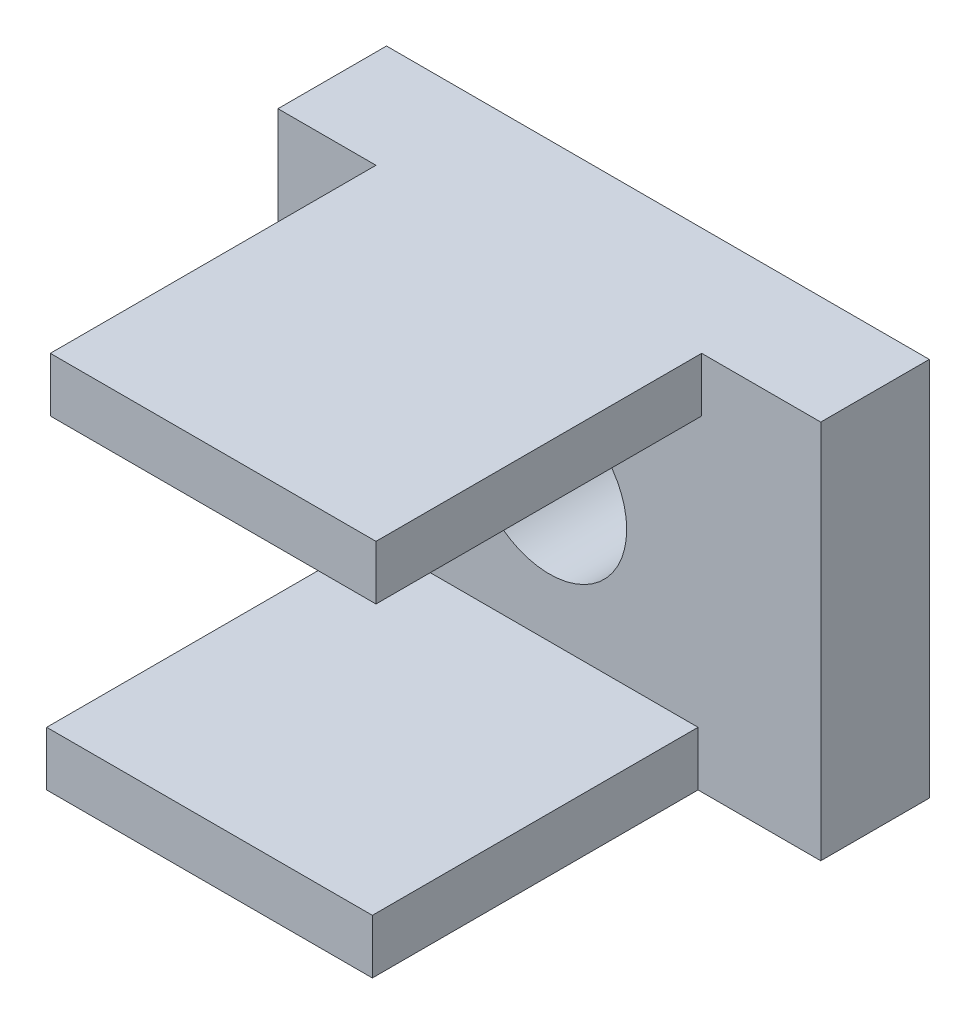
ISO-10303-21;
HEADER;
FILE_DESCRIPTION(('STEP AP214'),'2;1');
FILE_NAME('part.step','',(''),(''),'','','');
FILE_SCHEMA(('AUTOMOTIVE_DESIGN { 1 0 10303 214 1 1 1 1 }'));
ENDSEC;
DATA;
#1=APPLICATION_CONTEXT('core data for automotive mechanical design processes');
#2=APPLICATION_PROTOCOL_DEFINITION('international standard','automotive_design',2000,#1);
#3=PRODUCT_CONTEXT('',#1,'mechanical');
#4=PRODUCT('Part','Part','',(#3));
#5=PRODUCT_RELATED_PRODUCT_CATEGORY('part','',(#4));
#6=PRODUCT_DEFINITION_FORMATION('','',#4);
#7=PRODUCT_DEFINITION_CONTEXT('part definition',#1,'design');
#8=PRODUCT_DEFINITION('design','',#6,#7);
#9=PRODUCT_DEFINITION_SHAPE('','',#8);
#10=(LENGTH_UNIT() NAMED_UNIT(*) SI_UNIT(.MILLI.,.METRE.));
#11=(NAMED_UNIT(*) PLANE_ANGLE_UNIT() SI_UNIT($,.RADIAN.));
#12=(NAMED_UNIT(*) SI_UNIT($,.STERADIAN.) SOLID_ANGLE_UNIT());
#13=UNCERTAINTY_MEASURE_WITH_UNIT(LENGTH_MEASURE(1.E-05),#10,'distance_accuracy_value','');
#14=(GEOMETRIC_REPRESENTATION_CONTEXT(3) GLOBAL_UNCERTAINTY_ASSIGNED_CONTEXT((#13)) GLOBAL_UNIT_ASSIGNED_CONTEXT((#10,
#11,#12)) REPRESENTATION_CONTEXT('',''));
#15=CARTESIAN_POINT('',(0.,0.,0.));
#16=DIRECTION('',(0.,0.,1.));
#17=DIRECTION('',(1.,0.,0.));
#18=AXIS2_PLACEMENT_3D('',#15,#16,#17);
#19=CARTESIAN_POINT('',(0.,0.,2.));
#20=DIRECTION('',(0.,0.,1.));
#21=DIRECTION('',(1.,0.,0.));
#22=AXIS2_PLACEMENT_3D('',#19,#20,#21);
#23=PLANE('',#22);
#24=CARTESIAN_POINT('',(0.,0.,2.));
#25=DIRECTION('',(0.,0.,1.));
#26=DIRECTION('',(1.,0.,0.));
#27=AXIS2_PLACEMENT_3D('',#24,#25,#26);
#28=CIRCLE('',#27,1.425);
#29=CARTESIAN_POINT('',(1.425,0.,2.));
#30=VERTEX_POINT('',#29);
#31=EDGE_CURVE('E409',#30,#30,#28,.T.);
#32=ORIENTED_EDGE('',*,*,#31,.F.);
#33=EDGE_LOOP('',(#32));
#34=FACE_BOUND('',#33,.T.);
#35=DIRECTION('',(-1.,0.,0.));
#36=VECTOR('',#35,1.);
#37=CARTESIAN_POINT('',(-3.26050355642215,-2.5,2.));
#38=LINE('',#37,#36);
#39=CARTESIAN_POINT('',(2.73949644357785,-2.5,2.));
#40=VERTEX_POINT('',#39);
#41=CARTESIAN_POINT('',(-3.26050355642215,-2.5,2.));
#42=VERTEX_POINT('',#41);
#43=EDGE_CURVE('E56',#40,#42,#38,.T.);
#44=ORIENTED_EDGE('',*,*,#43,.F.);
#45=DIRECTION('',(0.,1.,0.));
#46=VECTOR('',#45,1.);
#47=CARTESIAN_POINT('',(2.73949644357785,-2.5,2.));
#48=LINE('',#47,#46);
#49=CARTESIAN_POINT('',(2.73949644357785,-3.5,2.));
#50=VERTEX_POINT('',#49);
#51=EDGE_CURVE('E152',#50,#40,#48,.T.);
#52=ORIENTED_EDGE('',*,*,#51,.F.);
#53=DIRECTION('',(1.,0.,0.));
#54=VECTOR('',#53,1.);
#55=CARTESIAN_POINT('',(-5.,-3.5,2.));
#56=LINE('',#55,#54);
#57=CARTESIAN_POINT('',(5.,-3.5,2.));
#58=VERTEX_POINT('',#57);
#59=EDGE_CURVE('E214',#50,#58,#56,.T.);
#60=ORIENTED_EDGE('',*,*,#59,.T.);
#61=DIRECTION('',(0.,1.,0.));
#62=VECTOR('',#61,1.);
#63=CARTESIAN_POINT('',(5.,3.5,2.));
#64=LINE('',#63,#62);
#65=CARTESIAN_POINT('',(5.,3.5,2.));
#66=VERTEX_POINT('',#65);
#67=EDGE_CURVE('E202',#58,#66,#64,.T.);
#68=ORIENTED_EDGE('',*,*,#67,.T.);
#69=DIRECTION('',(-1.,0.,0.));
#70=VECTOR('',#69,1.);
#71=CARTESIAN_POINT('',(-5.,3.5,2.));
#72=LINE('',#71,#70);
#73=CARTESIAN_POINT('',(2.80607660162224,3.5,2.));
#74=VERTEX_POINT('',#73);
#75=EDGE_CURVE('E208',#66,#74,#72,.T.);
#76=ORIENTED_EDGE('',*,*,#75,.T.);
#77=DIRECTION('',(0.,1.,0.));
#78=VECTOR('',#77,1.);
#79=CARTESIAN_POINT('',(2.80607660162224,2.5,2.));
#80=LINE('',#79,#78);
#81=CARTESIAN_POINT('',(2.80607660162224,2.5,2.));
#82=VERTEX_POINT('',#81);
#83=EDGE_CURVE('E154',#82,#74,#80,.T.);
#84=ORIENTED_EDGE('',*,*,#83,.F.);
#85=DIRECTION('',(1.,0.,0.));
#86=VECTOR('',#85,1.);
#87=CARTESIAN_POINT('',(-3.19392339837776,2.5,2.));
#88=LINE('',#87,#86);
#89=CARTESIAN_POINT('',(-3.19392339837776,2.5,2.));
#90=VERTEX_POINT('',#89);
#91=EDGE_CURVE('E170',#90,#82,#88,.T.);
#92=ORIENTED_EDGE('',*,*,#91,.F.);
#93=DIRECTION('',(0.,-1.,0.));
#94=VECTOR('',#93,1.);
#95=CARTESIAN_POINT('',(-3.19392339837776,2.5,2.));
#96=LINE('',#95,#94);
#97=CARTESIAN_POINT('',(-3.19392339837776,3.5,2.));
#98=VERTEX_POINT('',#97);
#99=EDGE_CURVE('E159',#98,#90,#96,.T.);
#100=ORIENTED_EDGE('',*,*,#99,.F.);
#101=CARTESIAN_POINT('',(-5.,3.5,2.));
#102=VERTEX_POINT('',#101);
#103=EDGE_CURVE('E206',#98,#102,#72,.T.);
#104=ORIENTED_EDGE('',*,*,#103,.T.);
#105=DIRECTION('',(0.,-1.,0.));
#106=VECTOR('',#105,1.);
#107=CARTESIAN_POINT('',(-5.,3.5,2.));
#108=LINE('',#107,#106);
#109=CARTESIAN_POINT('',(-5.,-3.5,2.));
#110=VERTEX_POINT('',#109);
#111=EDGE_CURVE('E211',#102,#110,#108,.T.);
#112=ORIENTED_EDGE('',*,*,#111,.T.);
#113=CARTESIAN_POINT('',(-3.26050355642215,-3.5,2.));
#114=VERTEX_POINT('',#113);
#115=EDGE_CURVE('E215',#110,#114,#56,.T.);
#116=ORIENTED_EDGE('',*,*,#115,.T.);
#117=DIRECTION('',(0.,-1.,0.));
#118=VECTOR('',#117,1.);
#119=CARTESIAN_POINT('',(-3.26050355642215,-2.5,2.));
#120=LINE('',#119,#118);
#121=EDGE_CURVE('E61',#42,#114,#120,.T.);
#122=ORIENTED_EDGE('',*,*,#121,.F.);
#123=EDGE_LOOP('',(#44,#52,#60,#68,#76,#84,#92,#100,#104,#112,#116,#122));
#124=FACE_BOUND('',#123,.T.);
#125=ADVANCED_FACE('F39',(#34,#124),#23,.T.);
#126=CARTESIAN_POINT('',(5.,3.5,2.));
#127=DIRECTION('',(-1.,0.,0.));
#128=DIRECTION('',(0.,0.,1.));
#129=AXIS2_PLACEMENT_3D('',#126,#127,#128);
#130=PLANE('',#129);
#131=DIRECTION('',(0.,1.,0.));
#132=VECTOR('',#131,1.);
#133=CARTESIAN_POINT('',(5.,3.5,0.));
#134=LINE('',#133,#132);
#135=CARTESIAN_POINT('',(5.,-3.5,0.));
#136=VERTEX_POINT('',#135);
#137=CARTESIAN_POINT('',(5.,3.5,0.));
#138=VERTEX_POINT('',#137);
#139=EDGE_CURVE('E201',#136,#138,#134,.T.);
#140=ORIENTED_EDGE('',*,*,#139,.T.);
#141=DIRECTION('',(0.,0.,-1.));
#142=VECTOR('',#141,1.);
#143=CARTESIAN_POINT('',(5.,3.5,2.));
#144=LINE('',#143,#142);
#145=EDGE_CURVE('E11',#66,#138,#144,.T.);
#146=ORIENTED_EDGE('',*,*,#145,.F.);
#147=ORIENTED_EDGE('',*,*,#67,.F.);
#148=DIRECTION('',(0.,0.,-1.));
#149=VECTOR('',#148,1.);
#150=CARTESIAN_POINT('',(5.,-3.5,2.));
#151=LINE('',#150,#149);
#152=EDGE_CURVE('E218',#58,#136,#151,.T.);
#153=ORIENTED_EDGE('',*,*,#152,.T.);
#154=EDGE_LOOP('',(#140,#146,#147,#153));
#155=FACE_BOUND('',#154,.T.);
#156=ADVANCED_FACE('F41',(#155),#130,.F.);
#157=CARTESIAN_POINT('',(-5.,3.5,2.));
#158=DIRECTION('',(0.,-1.,0.));
#159=DIRECTION('',(0.,0.,-1.));
#160=AXIS2_PLACEMENT_3D('',#157,#158,#159);
#161=PLANE('',#160);
#162=DIRECTION('',(-1.,0.,0.));
#163=VECTOR('',#162,1.);
#164=CARTESIAN_POINT('',(-5.,3.5,0.));
#165=LINE('',#164,#163);
#166=CARTESIAN_POINT('',(-5.,3.5,0.));
#167=VERTEX_POINT('',#166);
#168=EDGE_CURVE('E222',#138,#167,#165,.T.);
#169=ORIENTED_EDGE('',*,*,#168,.T.);
#170=DIRECTION('',(0.,0.,-1.));
#171=VECTOR('',#170,1.);
#172=CARTESIAN_POINT('',(-5.,3.5,2.));
#173=LINE('',#172,#171);
#174=EDGE_CURVE('E49',#102,#167,#173,.T.);
#175=ORIENTED_EDGE('',*,*,#174,.F.);
#176=ORIENTED_EDGE('',*,*,#103,.F.);
#177=DIRECTION('',(0.,0.,-1.));
#178=VECTOR('',#177,1.);
#179=CARTESIAN_POINT('',(-3.19392339837776,3.5,8.));
#180=LINE('',#179,#178);
#181=CARTESIAN_POINT('',(-3.19392339837776,3.5,8.));
#182=VERTEX_POINT('',#181);
#183=EDGE_CURVE('E193',#182,#98,#180,.T.);
#184=ORIENTED_EDGE('',*,*,#183,.F.);
#185=DIRECTION('',(-1.,0.,0.));
#186=VECTOR('',#185,1.);
#187=CARTESIAN_POINT('',(-3.19392339837776,3.5,8.));
#188=LINE('',#187,#186);
#189=CARTESIAN_POINT('',(2.80607660162224,3.5,8.));
#190=VERTEX_POINT('',#189);
#191=EDGE_CURVE('E169',#190,#182,#188,.T.);
#192=ORIENTED_EDGE('',*,*,#191,.F.);
#193=DIRECTION('',(0.,0.,-1.));
#194=VECTOR('',#193,1.);
#195=CARTESIAN_POINT('',(2.80607660162224,3.5,8.));
#196=LINE('',#195,#194);
#197=EDGE_CURVE('E197',#190,#74,#196,.T.);
#198=ORIENTED_EDGE('',*,*,#197,.T.);
#199=ORIENTED_EDGE('',*,*,#75,.F.);
#200=ORIENTED_EDGE('',*,*,#145,.T.);
#201=EDGE_LOOP('',(#169,#175,#176,#184,#192,#198,#199,#200));
#202=FACE_BOUND('',#201,.T.);
#203=ADVANCED_FACE('F261',(#202),#161,.F.);
#204=CARTESIAN_POINT('',(-5.,3.5,2.));
#205=DIRECTION('',(1.,0.,0.));
#206=DIRECTION('',(0.,1.,0.));
#207=AXIS2_PLACEMENT_3D('',#204,#205,#206);
#208=PLANE('',#207);
#209=DIRECTION('',(0.,-1.,0.));
#210=VECTOR('',#209,1.);
#211=CARTESIAN_POINT('',(-5.,3.5,0.));
#212=LINE('',#211,#210);
#213=CARTESIAN_POINT('',(-5.,-3.5,0.));
#214=VERTEX_POINT('',#213);
#215=EDGE_CURVE('E225',#167,#214,#212,.T.);
#216=ORIENTED_EDGE('',*,*,#215,.T.);
#217=DIRECTION('',(0.,0.,-1.));
#218=VECTOR('',#217,1.);
#219=CARTESIAN_POINT('',(-5.,-3.5,2.));
#220=LINE('',#219,#218);
#221=EDGE_CURVE('E233',#110,#214,#220,.T.);
#222=ORIENTED_EDGE('',*,*,#221,.F.);
#223=ORIENTED_EDGE('',*,*,#111,.F.);
#224=ORIENTED_EDGE('',*,*,#174,.T.);
#225=EDGE_LOOP('',(#216,#222,#223,#224));
#226=FACE_BOUND('',#225,.T.);
#227=ADVANCED_FACE('F243',(#226),#208,.F.);
#228=CARTESIAN_POINT('',(-5.,-3.5,2.));
#229=DIRECTION('',(0.,1.,0.));
#230=DIRECTION('',(0.,0.,1.));
#231=AXIS2_PLACEMENT_3D('',#228,#229,#230);
#232=PLANE('',#231);
#233=DIRECTION('',(1.,0.,0.));
#234=VECTOR('',#233,1.);
#235=CARTESIAN_POINT('',(-5.,-3.5,0.));
#236=LINE('',#235,#234);
#237=EDGE_CURVE('E207',#214,#136,#236,.T.);
#238=ORIENTED_EDGE('',*,*,#237,.T.);
#239=ORIENTED_EDGE('',*,*,#152,.F.);
#240=ORIENTED_EDGE('',*,*,#59,.F.);
#241=DIRECTION('',(0.,0.,-1.));
#242=VECTOR('',#241,1.);
#243=CARTESIAN_POINT('',(2.73949644357785,-3.5,8.));
#244=LINE('',#243,#242);
#245=CARTESIAN_POINT('',(2.73949644357785,-3.5,8.));
#246=VERTEX_POINT('',#245);
#247=EDGE_CURVE('E421',#246,#50,#244,.T.);
#248=ORIENTED_EDGE('',*,*,#247,.F.);
#249=DIRECTION('',(1.,0.,0.));
#250=VECTOR('',#249,1.);
#251=CARTESIAN_POINT('',(-3.26050355642215,-3.5,8.));
#252=LINE('',#251,#250);
#253=CARTESIAN_POINT('',(-3.26050355642215,-3.5,8.));
#254=VERTEX_POINT('',#253);
#255=EDGE_CURVE('E145',#254,#246,#252,.T.);
#256=ORIENTED_EDGE('',*,*,#255,.F.);
#257=DIRECTION('',(0.,0.,-1.));
#258=VECTOR('',#257,1.);
#259=CARTESIAN_POINT('',(-3.26050355642215,-3.5,8.));
#260=LINE('',#259,#258);
#261=EDGE_CURVE('E161',#254,#114,#260,.T.);
#262=ORIENTED_EDGE('',*,*,#261,.T.);
#263=ORIENTED_EDGE('',*,*,#115,.F.);
#264=ORIENTED_EDGE('',*,*,#221,.T.);
#265=EDGE_LOOP('',(#238,#239,#240,#248,#256,#262,#263,#264));
#266=FACE_BOUND('',#265,.T.);
#267=ADVANCED_FACE('F253',(#266),#232,.F.);
#268=CARTESIAN_POINT('',(0.,0.,0.));
#269=DIRECTION('',(0.,0.,1.));
#270=DIRECTION('',(1.,0.,0.));
#271=AXIS2_PLACEMENT_3D('',#268,#269,#270);
#272=PLANE('',#271);
#273=CARTESIAN_POINT('',(0.,0.,0.));
#274=DIRECTION('',(0.,0.,1.));
#275=DIRECTION('',(1.,0.,0.));
#276=AXIS2_PLACEMENT_3D('',#273,#274,#275);
#277=CIRCLE('',#276,1.425);
#278=CARTESIAN_POINT('',(1.425,0.,0.));
#279=VERTEX_POINT('',#278);
#280=EDGE_CURVE('E43',#279,#279,#277,.T.);
#281=ORIENTED_EDGE('',*,*,#280,.T.);
#282=EDGE_LOOP('',(#281));
#283=FACE_BOUND('',#282,.T.);
#284=ORIENTED_EDGE('',*,*,#139,.F.);
#285=ORIENTED_EDGE('',*,*,#237,.F.);
#286=ORIENTED_EDGE('',*,*,#215,.F.);
#287=ORIENTED_EDGE('',*,*,#168,.F.);
#288=EDGE_LOOP('',(#284,#285,#286,#287));
#289=FACE_BOUND('',#288,.T.);
#290=ADVANCED_FACE('F250',(#283,#289),#272,.F.);
#291=CARTESIAN_POINT('',(2.80607660162224,2.5,8.));
#292=DIRECTION('',(-1.,0.,0.));
#293=DIRECTION('',(0.,0.,1.));
#294=AXIS2_PLACEMENT_3D('',#291,#292,#293);
#295=PLANE('',#294);
#296=ORIENTED_EDGE('',*,*,#83,.T.);
#297=ORIENTED_EDGE('',*,*,#197,.F.);
#298=DIRECTION('',(0.,1.,0.));
#299=VECTOR('',#298,1.);
#300=CARTESIAN_POINT('',(2.80607660162224,2.5,8.));
#301=LINE('',#300,#299);
#302=CARTESIAN_POINT('',(2.80607660162224,2.5,8.));
#303=VERTEX_POINT('',#302);
#304=EDGE_CURVE('E165',#303,#190,#301,.T.);
#305=ORIENTED_EDGE('',*,*,#304,.F.);
#306=DIRECTION('',(0.,0.,-1.));
#307=VECTOR('',#306,1.);
#308=CARTESIAN_POINT('',(2.80607660162224,2.5,8.));
#309=LINE('',#308,#307);
#310=EDGE_CURVE('E178',#303,#82,#309,.T.);
#311=ORIENTED_EDGE('',*,*,#310,.T.);
#312=EDGE_LOOP('',(#296,#297,#305,#311));
#313=FACE_BOUND('',#312,.T.);
#314=ADVANCED_FACE('F273',(#313),#295,.F.);
#315=CARTESIAN_POINT('',(-3.19392339837776,2.5,8.));
#316=DIRECTION('',(1.,0.,0.));
#317=DIRECTION('',(0.,0.,-1.));
#318=AXIS2_PLACEMENT_3D('',#315,#316,#317);
#319=PLANE('',#318);
#320=ORIENTED_EDGE('',*,*,#99,.T.);
#321=DIRECTION('',(0.,0.,-1.));
#322=VECTOR('',#321,1.);
#323=CARTESIAN_POINT('',(-3.19392339837776,2.5,8.));
#324=LINE('',#323,#322);
#325=CARTESIAN_POINT('',(-3.19392339837776,2.5,8.));
#326=VERTEX_POINT('',#325);
#327=EDGE_CURVE('E189',#326,#90,#324,.T.);
#328=ORIENTED_EDGE('',*,*,#327,.F.);
#329=DIRECTION('',(0.,-1.,0.));
#330=VECTOR('',#329,1.);
#331=CARTESIAN_POINT('',(-3.19392339837776,2.5,8.));
#332=LINE('',#331,#330);
#333=EDGE_CURVE('E173',#182,#326,#332,.T.);
#334=ORIENTED_EDGE('',*,*,#333,.F.);
#335=ORIENTED_EDGE('',*,*,#183,.T.);
#336=EDGE_LOOP('',(#320,#328,#334,#335));
#337=FACE_BOUND('',#336,.T.);
#338=ADVANCED_FACE('F264',(#337),#319,.F.);
#339=CARTESIAN_POINT('',(-3.19392339837776,2.5,8.));
#340=DIRECTION('',(0.,1.,0.));
#341=DIRECTION('',(0.,0.,1.));
#342=AXIS2_PLACEMENT_3D('',#339,#340,#341);
#343=PLANE('',#342);
#344=ORIENTED_EDGE('',*,*,#91,.T.);
#345=ORIENTED_EDGE('',*,*,#310,.F.);
#346=DIRECTION('',(1.,0.,0.));
#347=VECTOR('',#346,1.);
#348=CARTESIAN_POINT('',(-3.19392339837776,2.5,8.));
#349=LINE('',#348,#347);
#350=EDGE_CURVE('E176',#326,#303,#349,.T.);
#351=ORIENTED_EDGE('',*,*,#350,.F.);
#352=ORIENTED_EDGE('',*,*,#327,.T.);
#353=EDGE_LOOP('',(#344,#345,#351,#352));
#354=FACE_BOUND('',#353,.T.);
#355=ADVANCED_FACE('F275',(#354),#343,.F.);
#356=CARTESIAN_POINT('',(0.,0.,8.));
#357=DIRECTION('',(0.,0.,-1.));
#358=DIRECTION('',(-1.,0.,0.));
#359=AXIS2_PLACEMENT_3D('',#356,#357,#358);
#360=PLANE('',#359);
#361=ORIENTED_EDGE('',*,*,#304,.T.);
#362=ORIENTED_EDGE('',*,*,#191,.T.);
#363=ORIENTED_EDGE('',*,*,#333,.T.);
#364=ORIENTED_EDGE('',*,*,#350,.T.);
#365=EDGE_LOOP('',(#361,#362,#363,#364));
#366=FACE_BOUND('',#365,.T.);
#367=ADVANCED_FACE('F268',(#366),#360,.F.);
#368=CARTESIAN_POINT('',(2.73949644357785,-2.5,8.));
#369=DIRECTION('',(-1.,0.,0.));
#370=DIRECTION('',(0.,0.,1.));
#371=AXIS2_PLACEMENT_3D('',#368,#369,#370);
#372=PLANE('',#371);
#373=ORIENTED_EDGE('',*,*,#51,.T.);
#374=DIRECTION('',(0.,0.,-1.));
#375=VECTOR('',#374,1.);
#376=CARTESIAN_POINT('',(2.73949644357785,-2.5,8.));
#377=LINE('',#376,#375);
#378=CARTESIAN_POINT('',(2.73949644357785,-2.5,8.));
#379=VERTEX_POINT('',#378);
#380=EDGE_CURVE('E132',#379,#40,#377,.T.);
#381=ORIENTED_EDGE('',*,*,#380,.F.);
#382=DIRECTION('',(0.,1.,0.));
#383=VECTOR('',#382,1.);
#384=CARTESIAN_POINT('',(2.73949644357785,-2.5,8.));
#385=LINE('',#384,#383);
#386=EDGE_CURVE('E140',#246,#379,#385,.T.);
#387=ORIENTED_EDGE('',*,*,#386,.F.);
#388=ORIENTED_EDGE('',*,*,#247,.T.);
#389=EDGE_LOOP('',(#373,#381,#387,#388));
#390=FACE_BOUND('',#389,.T.);
#391=ADVANCED_FACE('F151',(#390),#372,.F.);
#392=CARTESIAN_POINT('',(-3.26050355642215,-2.5,8.));
#393=DIRECTION('',(0.,-1.,0.));
#394=DIRECTION('',(0.,0.,-1.));
#395=AXIS2_PLACEMENT_3D('',#392,#393,#394);
#396=PLANE('',#395);
#397=ORIENTED_EDGE('',*,*,#43,.T.);
#398=DIRECTION('',(0.,0.,-1.));
#399=VECTOR('',#398,1.);
#400=CARTESIAN_POINT('',(-3.26050355642215,-2.5,8.));
#401=LINE('',#400,#399);
#402=CARTESIAN_POINT('',(-3.26050355642215,-2.5,8.));
#403=VERTEX_POINT('',#402);
#404=EDGE_CURVE('E135',#403,#42,#401,.T.);
#405=ORIENTED_EDGE('',*,*,#404,.F.);
#406=DIRECTION('',(-1.,0.,0.));
#407=VECTOR('',#406,1.);
#408=CARTESIAN_POINT('',(-3.26050355642215,-2.5,8.));
#409=LINE('',#408,#407);
#410=EDGE_CURVE('E128',#379,#403,#409,.T.);
#411=ORIENTED_EDGE('',*,*,#410,.F.);
#412=ORIENTED_EDGE('',*,*,#380,.T.);
#413=EDGE_LOOP('',(#397,#405,#411,#412));
#414=FACE_BOUND('',#413,.T.);
#415=ADVANCED_FACE('F130',(#414),#396,.F.);
#416=CARTESIAN_POINT('',(-3.26050355642215,-2.5,8.));
#417=DIRECTION('',(1.,0.,0.));
#418=DIRECTION('',(0.,0.,-1.));
#419=AXIS2_PLACEMENT_3D('',#416,#417,#418);
#420=PLANE('',#419);
#421=ORIENTED_EDGE('',*,*,#121,.T.);
#422=ORIENTED_EDGE('',*,*,#261,.F.);
#423=DIRECTION('',(0.,-1.,0.));
#424=VECTOR('',#423,1.);
#425=CARTESIAN_POINT('',(-3.26050355642215,-2.5,8.));
#426=LINE('',#425,#424);
#427=EDGE_CURVE('E139',#403,#254,#426,.T.);
#428=ORIENTED_EDGE('',*,*,#427,.F.);
#429=ORIENTED_EDGE('',*,*,#404,.T.);
#430=EDGE_LOOP('',(#421,#422,#428,#429));
#431=FACE_BOUND('',#430,.T.);
#432=ADVANCED_FACE('F353',(#431),#420,.F.);
#433=CARTESIAN_POINT('',(0.,0.,8.));
#434=DIRECTION('',(0.,0.,1.));
#435=DIRECTION('',(1.,0.,0.));
#436=AXIS2_PLACEMENT_3D('',#433,#434,#435);
#437=PLANE('',#436);
#438=ORIENTED_EDGE('',*,*,#386,.T.);
#439=ORIENTED_EDGE('',*,*,#410,.T.);
#440=ORIENTED_EDGE('',*,*,#427,.T.);
#441=ORIENTED_EDGE('',*,*,#255,.T.);
#442=EDGE_LOOP('',(#438,#439,#440,#441));
#443=FACE_BOUND('',#442,.T.);
#444=ADVANCED_FACE('F143',(#443),#437,.T.);
#445=CARTESIAN_POINT('',(0.,0.,-4.));
#446=DIRECTION('',(0.,0.,1.));
#447=DIRECTION('',(1.,0.,0.));
#448=AXIS2_PLACEMENT_3D('',#445,#446,#447);
#449=CYLINDRICAL_SURFACE('',#448,1.425);
#450=ORIENTED_EDGE('',*,*,#31,.T.);
#451=EDGE_LOOP('',(#450));
#452=FACE_BOUND('',#451,.T.);
#453=ORIENTED_EDGE('',*,*,#280,.F.);
#454=EDGE_LOOP('',(#453));
#455=FACE_BOUND('',#454,.T.);
#456=ADVANCED_FACE('F370',(#452,#455),#449,.F.);
#457=CLOSED_SHELL('',(#125,#156,#203,#227,#267,#290,#314,#338,#355,#367,#391,#415,#432,#444,#456));
#458=MANIFOLD_SOLID_BREP('B2',#457);
#459=ADVANCED_BREP_SHAPE_REPRESENTATION('',(#18,#458),#14);
#460=SHAPE_DEFINITION_REPRESENTATION(#9,#459);
ENDSEC;
END-ISO-10303-21;
